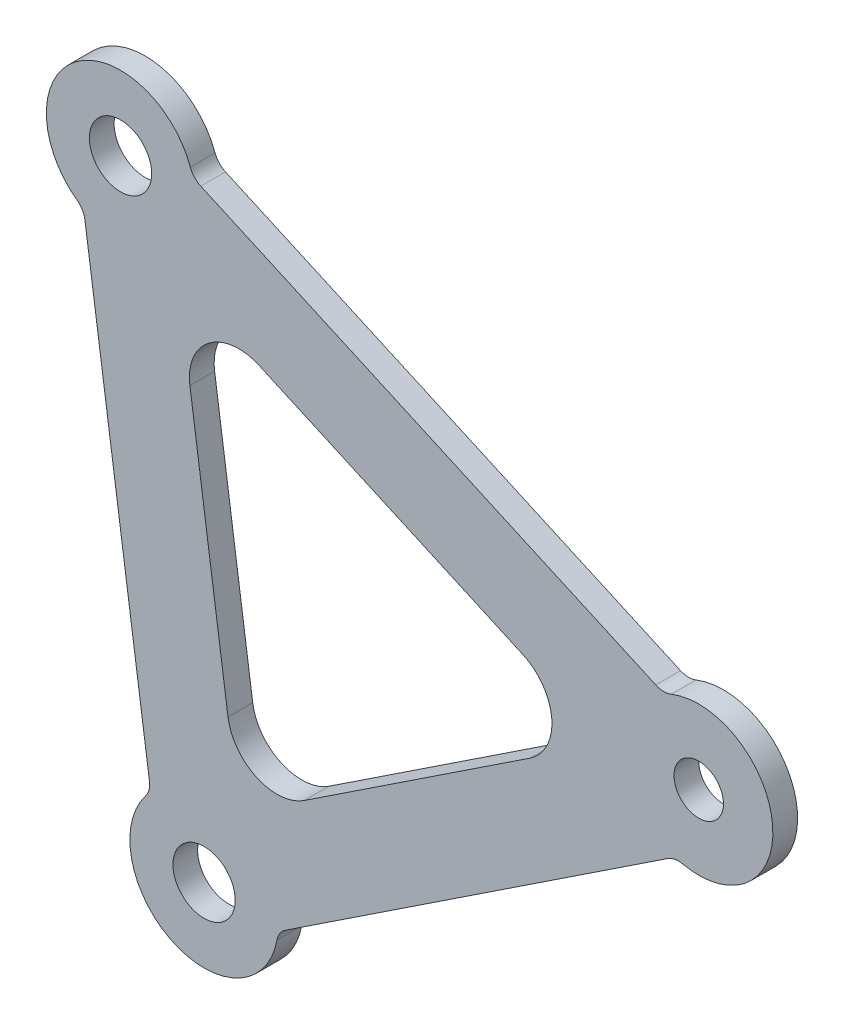
ISO-10303-21;
HEADER;
FILE_DESCRIPTION(('STEP AP214'),'2;1');
FILE_NAME('part.step','',(''),(''),'','','');
FILE_SCHEMA(('AUTOMOTIVE_DESIGN { 1 0 10303 214 1 1 1 1 }'));
ENDSEC;
DATA;
#1=APPLICATION_CONTEXT('core data for automotive mechanical design processes');
#2=APPLICATION_PROTOCOL_DEFINITION('international standard','automotive_design',2000,#1);
#3=PRODUCT_CONTEXT('',#1,'mechanical');
#4=PRODUCT('Part','Part','',(#3));
#5=PRODUCT_RELATED_PRODUCT_CATEGORY('part','',(#4));
#6=PRODUCT_DEFINITION_FORMATION('','',#4);
#7=PRODUCT_DEFINITION_CONTEXT('part definition',#1,'design');
#8=PRODUCT_DEFINITION('design','',#6,#7);
#9=PRODUCT_DEFINITION_SHAPE('','',#8);
#10=(LENGTH_UNIT() NAMED_UNIT(*) SI_UNIT(.MILLI.,.METRE.));
#11=(NAMED_UNIT(*) PLANE_ANGLE_UNIT() SI_UNIT($,.RADIAN.));
#12=(NAMED_UNIT(*) SI_UNIT($,.STERADIAN.) SOLID_ANGLE_UNIT());
#13=UNCERTAINTY_MEASURE_WITH_UNIT(LENGTH_MEASURE(1.E-05),#10,'distance_accuracy_value','');
#14=(GEOMETRIC_REPRESENTATION_CONTEXT(3) GLOBAL_UNCERTAINTY_ASSIGNED_CONTEXT((#13)) GLOBAL_UNIT_ASSIGNED_CONTEXT((#10,
#11,#12)) REPRESENTATION_CONTEXT('',''));
#15=CARTESIAN_POINT('',(0.,0.,0.));
#16=DIRECTION('',(0.,0.,1.));
#17=DIRECTION('',(1.,0.,0.));
#18=AXIS2_PLACEMENT_3D('',#15,#16,#17);
#19=CARTESIAN_POINT('',(0.,0.,1580.80491284533));
#20=DIRECTION('',(0.,0.,1.));
#21=DIRECTION('',(1.,0.,0.));
#22=AXIS2_PLACEMENT_3D('',#19,#20,#21);
#23=PLANE('',#22);
#24=CARTESIAN_POINT('',(226.780244032759,617.201596269697,1580.80491284533));
#25=DIRECTION('',(0.,0.,1.));
#26=DIRECTION('',(1.,0.,0.));
#27=AXIS2_PLACEMENT_3D('',#24,#25,#26);
#28=CIRCLE('',#27,4.00000000000002);
#29=CARTESIAN_POINT('',(230.780244032759,617.201596269697,1580.80491284533));
#30=VERTEX_POINT('',#29);
#31=EDGE_CURVE('E194',#30,#30,#28,.T.);
#32=ORIENTED_EDGE('',*,*,#31,.F.);
#33=EDGE_LOOP('',(#32));
#34=FACE_BOUND('',#33,.T.);
#35=CARTESIAN_POINT('',(216.050914922103,692.64244393749,1580.80491284533));
#36=DIRECTION('',(0.,0.,1.));
#37=DIRECTION('',(1.,0.,0.));
#38=AXIS2_PLACEMENT_3D('',#35,#36,#37);
#39=CIRCLE('',#38,4.00000000000002);
#40=CARTESIAN_POINT('',(220.050914922103,692.64244393749,1580.80491284533));
#41=VERTEX_POINT('',#40);
#42=EDGE_CURVE('E295',#41,#41,#39,.T.);
#43=ORIENTED_EDGE('',*,*,#42,.F.);
#44=EDGE_LOOP('',(#43));
#45=FACE_BOUND('',#44,.T.);
#46=CARTESIAN_POINT('',(290.308718482655,659.279772728152,1580.80491284533));
#47=DIRECTION('',(0.,0.,1.));
#48=DIRECTION('',(1.,0.,0.));
#49=AXIS2_PLACEMENT_3D('',#46,#47,#48);
#50=CIRCLE('',#49,3.17500000000002);
#51=CARTESIAN_POINT('',(293.483718482656,659.279772728152,1580.80491284533));
#52=VERTEX_POINT('',#51);
#53=EDGE_CURVE('E186',#52,#52,#50,.T.);
#54=ORIENTED_EDGE('',*,*,#53,.F.);
#55=EDGE_LOOP('',(#54));
#56=FACE_BOUND('',#55,.T.);
#57=CARTESIAN_POINT('',(290.308718482656,659.279772728152,1580.80491284533));
#58=DIRECTION('',(0.,0.,1.));
#59=DIRECTION('',(1.,0.,0.));
#60=AXIS2_PLACEMENT_3D('',#57,#58,#59);
#61=CIRCLE('',#60,9.52499999999998);
#62=CARTESIAN_POINT('',(288.261525890208,649.977373710188,1580.80491284533));
#63=VERTEX_POINT('',#62);
#64=CARTESIAN_POINT('',(286.78126341768,668.127523050385,1580.80491284533));
#65=VERTEX_POINT('',#64);
#66=EDGE_CURVE('E374',#63,#65,#61,.T.);
#67=ORIENTED_EDGE('',*,*,#66,.T.);
#68=CARTESIAN_POINT('',(285.840608733686,670.486923136314,1580.80491284533));
#69=DIRECTION('',(0.,0.,1.));
#70=DIRECTION('',(1.,0.,0.));
#71=AXIS2_PLACEMENT_3D('',#68,#69,#70);
#72=CIRCLE('',#71,2.54);
#73=CARTESIAN_POINT('',(284.799666641854,668.170020125515,1580.80491284533));
#74=VERTEX_POINT('',#73);
#75=EDGE_CURVE('E244',#65,#74,#72,.F.);
#76=ORIENTED_EDGE('',*,*,#75,.T.);
#77=DIRECTION('',(-0.912166539684771,0.40981972119398,0.));
#78=VECTOR('',#77,1.);
#79=CARTESIAN_POINT('',(297.610612352361,662.414296832786,1580.80491284533));
#80=LINE('',#79,#78);
#81=CARTESIAN_POINT('',(226.356224769418,694.427588246853,1580.80491284533));
#82=VERTEX_POINT('',#81);
#83=EDGE_CURVE('E378',#74,#82,#80,.T.);
#84=ORIENTED_EDGE('',*,*,#83,.T.);
#85=CARTESIAN_POINT('',(227.39716686125,696.744491257652,1580.80491284533));
#86=DIRECTION('',(0.,0.,1.));
#87=DIRECTION('',(1.,0.,0.));
#88=AXIS2_PLACEMENT_3D('',#85,#86,#87);
#89=CIRCLE('',#88,2.54);
#90=CARTESIAN_POINT('',(225.008482244984,695.8809023485,1580.80491284533));
#91=VERTEX_POINT('',#90);
#92=EDGE_CURVE('E12',#82,#91,#89,.F.);
#93=ORIENTED_EDGE('',*,*,#92,.T.);
#94=CARTESIAN_POINT('',(216.050914933983,692.64244393918,1580.80491284533));
#95=DIRECTION('',(0.,0.,1.));
#96=DIRECTION('',(1.,0.,0.));
#97=AXIS2_PLACEMENT_3D('',#94,#95,#96);
#98=CIRCLE('',#97,9.52500000000004);
#99=CARTESIAN_POINT('',(210.455529521926,684.934182975088,1580.80491284533));
#100=VERTEX_POINT('',#99);
#101=EDGE_CURVE('E279',#91,#100,#98,.T.);
#102=ORIENTED_EDGE('',*,*,#101,.T.);
#103=CARTESIAN_POINT('',(208.963426745378,682.878646717997,1580.80491284533));
#104=DIRECTION('',(0.,0.,1.));
#105=DIRECTION('',(1.,0.,0.));
#106=AXIS2_PLACEMENT_3D('',#103,#104,#105);
#107=CIRCLE('',#106,2.54);
#108=CARTESIAN_POINT('',(211.478121667694,683.23629102129,1580.80491284533));
#109=VERTEX_POINT('',#108);
#110=EDGE_CURVE('E260',#100,#109,#107,.F.);
#111=ORIENTED_EDGE('',*,*,#110,.T.);
#112=DIRECTION('',(0.140804843815963,-0.990037370990592,0.));
#113=VECTOR('',#112,1.);
#114=CARTESIAN_POINT('',(302.529900227524,43.0263307218127,1580.80491284533));
#115=LINE('',#114,#113);
#116=CARTESIAN_POINT('',(219.766297064193,624.959862757328,1580.80491284533));
#117=VERTEX_POINT('',#116);
#118=EDGE_CURVE('E281',#109,#117,#115,.T.);
#119=ORIENTED_EDGE('',*,*,#118,.T.);
#120=CARTESIAN_POINT('',(217.251602141877,624.602218454036,1580.80491284533));
#121=DIRECTION('',(0.,0.,1.));
#122=DIRECTION('',(1.,0.,0.));
#123=AXIS2_PLACEMENT_3D('',#120,#121,#122);
#124=CIRCLE('',#123,2.54);
#125=CARTESIAN_POINT('',(219.257632013642,623.044192731017,1580.80491284533));
#126=VERTEX_POINT('',#125);
#127=EDGE_CURVE('E256',#117,#126,#124,.F.);
#128=ORIENTED_EDGE('',*,*,#127,.T.);
#129=CARTESIAN_POINT('',(226.780244032759,617.201596269697,1580.80491284533));
#130=DIRECTION('',(0.,0.,1.));
#131=DIRECTION('',(1.,0.,0.));
#132=AXIS2_PLACEMENT_3D('',#129,#130,#131);
#133=CIRCLE('',#132,9.52499999999998);
#134=CARTESIAN_POINT('',(236.144181170667,615.45737544729,1580.80491284533));
#135=VERTEX_POINT('',#134);
#136=EDGE_CURVE('E286',#126,#135,#133,.T.);
#137=ORIENTED_EDGE('',*,*,#136,.T.);
#138=CARTESIAN_POINT('',(238.641231074109,614.992249894648,1580.80491284533));
#139=DIRECTION('',(0.,0.,1.));
#140=DIRECTION('',(1.,0.,0.));
#141=AXIS2_PLACEMENT_3D('',#138,#139,#140);
#142=CIRCLE('',#141,2.54);
#143=CARTESIAN_POINT('',(237.238625192161,617.109865709645,1580.80491284533));
#144=VERTEX_POINT('',#143);
#145=EDGE_CURVE('E252',#135,#144,#142,.F.);
#146=ORIENTED_EDGE('',*,*,#145,.T.);
#147=DIRECTION('',(0.833707013778167,0.552207040137204,0.));
#148=VECTOR('',#147,1.);
#149=CARTESIAN_POINT('',(-211.762555904941,319.713287374378,1580.80491284533));
#150=LINE('',#149,#148);
#151=CARTESIAN_POINT('',(286.313001983606,649.61434978706,1580.80491284533));
#152=VERTEX_POINT('',#151);
#153=EDGE_CURVE('E372',#144,#152,#150,.T.);
#154=ORIENTED_EDGE('',*,*,#153,.T.);
#155=CARTESIAN_POINT('',(287.715607865555,647.496733972064,1580.80491284533));
#156=DIRECTION('',(0.,0.,1.));
#157=DIRECTION('',(1.,0.,0.));
#158=AXIS2_PLACEMENT_3D('',#155,#156,#157);
#159=CIRCLE('',#158,2.54);
#160=EDGE_CURVE('E248',#152,#63,#159,.F.);
#161=ORIENTED_EDGE('',*,*,#160,.T.);
#162=EDGE_LOOP('',(#67,#76,#84,#93,#102,#111,#119,#128,#137,#146,#154,#161));
#163=FACE_BOUND('',#162,.T.);
#164=DIRECTION('',(-0.833707013778166,-0.552207040137205,0.));
#165=VECTOR('',#164,1.);
#166=CARTESIAN_POINT('',(-218.225220565293,329.470440875522,1580.80491284533));
#167=LINE('',#166,#165);
#168=CARTESIAN_POINT('',(268.616255484679,651.930593018509,1580.80491284533));
#169=VERTEX_POINT('',#168);
#170=CARTESIAN_POINT('',(239.647905772852,632.743364906399,1580.80491284533));
#171=VERTEX_POINT('',#170);
#172=EDGE_CURVE('E182',#169,#171,#167,.T.);
#173=ORIENTED_EDGE('',*,*,#172,.T.);
#174=CARTESIAN_POINT('',(236.14139106798,638.037404443891,1580.80491284533));
#175=DIRECTION('',(0.,0.,1.));
#176=DIRECTION('',(1.,0.,0.));
#177=AXIS2_PLACEMENT_3D('',#174,#175,#176);
#178=CIRCLE('',#177,6.35);
#179=CARTESIAN_POINT('',(229.85465376219,637.14329368566,1580.80491284533));
#180=VERTEX_POINT('',#179);
#181=EDGE_CURVE('E171',#171,#180,#178,.F.);
#182=ORIENTED_EDGE('',*,*,#181,.T.);
#183=DIRECTION('',(-0.140804843815962,0.990037370990592,0.));
#184=VECTOR('',#183,1.);
#185=CARTESIAN_POINT('',(314.116640462379,44.6742171520719,1580.80491284533));
#186=LINE('',#185,#184);
#187=CARTESIAN_POINT('',(224.962186877583,671.543566579862,1580.80491284533));
#188=VERTEX_POINT('',#187);
#189=EDGE_CURVE('E392',#180,#188,#186,.T.);
#190=ORIENTED_EDGE('',*,*,#189,.T.);
#191=CARTESIAN_POINT('',(231.248924183374,672.437677338093,1580.80491284533));
#192=DIRECTION('',(0.,0.,1.));
#193=DIRECTION('',(1.,0.,0.));
#194=AXIS2_PLACEMENT_3D('',#191,#192,#193);
#195=CIRCLE('',#194,6.35);
#196=CARTESIAN_POINT('',(233.851279412955,678.229934865092,1580.80491284533));
#197=VERTEX_POINT('',#196);
#198=EDGE_CURVE('E211',#188,#197,#195,.F.);
#199=ORIENTED_EDGE('',*,*,#198,.T.);
#200=DIRECTION('',(0.912166539684771,-0.409819721193979,0.));
#201=VECTOR('',#200,1.);
#202=CARTESIAN_POINT('',(292.814354360761,651.738905119361,1580.80491284533));
#203=LINE('',#202,#201);
#204=CARTESIAN_POINT('',(267.712096009389,663.016890082999,1580.80491284533));
#205=VERTEX_POINT('',#204);
#206=EDGE_CURVE('E389',#197,#205,#203,.T.);
#207=ORIENTED_EDGE('',*,*,#206,.T.);
#208=CARTESIAN_POINT('',(265.109740779807,657.224632556,1580.80491284533));
#209=DIRECTION('',(0.,0.,1.));
#210=DIRECTION('',(1.,0.,0.));
#211=AXIS2_PLACEMENT_3D('',#208,#209,#210);
#212=CIRCLE('',#211,6.35);
#213=EDGE_CURVE('E172',#205,#169,#212,.F.);
#214=ORIENTED_EDGE('',*,*,#213,.T.);
#215=EDGE_LOOP('',(#173,#182,#190,#199,#207,#214));
#216=FACE_BOUND('',#215,.T.);
#217=ADVANCED_FACE('F36',(#34,#45,#56,#163,#216),#23,.T.);
#218=CARTESIAN_POINT('',(0.,0.,1577.62991284533));
#219=DIRECTION('',(0.,0.,1.));
#220=DIRECTION('',(1.,0.,0.));
#221=AXIS2_PLACEMENT_3D('',#218,#219,#220);
#222=PLANE('',#221);
#223=DIRECTION('',(-0.140804843815963,0.990037370990592,0.));
#224=VECTOR('',#223,1.);
#225=CARTESIAN_POINT('',(211.315771723324,684.377817887474,1577.62991284533));
#226=LINE('',#225,#224);
#227=CARTESIAN_POINT('',(219.766297064193,624.959862757328,1577.62991284533));
#228=VERTEX_POINT('',#227);
#229=CARTESIAN_POINT('',(211.478121667694,683.23629102129,1577.62991284533));
#230=VERTEX_POINT('',#229);
#231=EDGE_CURVE('E362',#228,#230,#226,.T.);
#232=ORIENTED_EDGE('',*,*,#231,.T.);
#233=CARTESIAN_POINT('',(208.963426745378,682.878646717997,1577.62991284533));
#234=DIRECTION('',(0.,0.,1.));
#235=DIRECTION('',(1.,0.,0.));
#236=AXIS2_PLACEMENT_3D('',#233,#234,#235);
#237=CIRCLE('',#236,2.54);
#238=CARTESIAN_POINT('',(210.455529521926,684.934182975088,1577.62991284533));
#239=VERTEX_POINT('',#238);
#240=EDGE_CURVE('E258',#230,#239,#237,.T.);
#241=ORIENTED_EDGE('',*,*,#240,.T.);
#242=CARTESIAN_POINT('',(216.050914933983,692.64244393918,1577.62991284533));
#243=DIRECTION('',(0.,0.,-1.));
#244=DIRECTION('',(1.,0.,0.));
#245=AXIS2_PLACEMENT_3D('',#242,#243,#244);
#246=CIRCLE('',#245,9.52500000000004);
#247=CARTESIAN_POINT('',(225.008482244984,695.8809023485,1577.62991284533));
#248=VERTEX_POINT('',#247);
#249=EDGE_CURVE('E268',#239,#248,#246,.T.);
#250=ORIENTED_EDGE('',*,*,#249,.T.);
#251=CARTESIAN_POINT('',(227.39716686125,696.744491257652,1577.62991284533));
#252=DIRECTION('',(0.,0.,1.));
#253=DIRECTION('',(1.,0.,0.));
#254=AXIS2_PLACEMENT_3D('',#251,#252,#253);
#255=CIRCLE('',#254,2.54);
#256=CARTESIAN_POINT('',(226.356224769418,694.427588246853,1577.62991284533));
#257=VERTEX_POINT('',#256);
#258=EDGE_CURVE('E44',#248,#257,#255,.T.);
#259=ORIENTED_EDGE('',*,*,#258,.T.);
#260=DIRECTION('',(0.912166539684771,-0.40981972119398,0.));
#261=VECTOR('',#260,1.);
#262=CARTESIAN_POINT('',(225.304484054278,694.900116088968,1577.62991284533));
#263=LINE('',#262,#261);
#264=CARTESIAN_POINT('',(284.799666641854,668.170020125515,1577.62991284533));
#265=VERTEX_POINT('',#264);
#266=EDGE_CURVE('E267',#257,#265,#263,.T.);
#267=ORIENTED_EDGE('',*,*,#266,.T.);
#268=CARTESIAN_POINT('',(285.840608733686,670.486923136314,1577.62991284533));
#269=DIRECTION('',(0.,0.,1.));
#270=DIRECTION('',(1.,0.,0.));
#271=AXIS2_PLACEMENT_3D('',#268,#269,#270);
#272=CIRCLE('',#271,2.54);
#273=CARTESIAN_POINT('',(286.78126341768,668.127523050385,1577.62991284533));
#274=VERTEX_POINT('',#273);
#275=EDGE_CURVE('E242',#265,#274,#272,.T.);
#276=ORIENTED_EDGE('',*,*,#275,.T.);
#277=CARTESIAN_POINT('',(290.308718482656,659.279772728152,1577.62991284533));
#278=DIRECTION('',(0.,0.,-1.));
#279=DIRECTION('',(1.,0.,0.));
#280=AXIS2_PLACEMENT_3D('',#277,#278,#279);
#281=CIRCLE('',#280,9.52499999999998);
#282=CARTESIAN_POINT('',(288.261525890208,649.977373710188,1577.62991284533));
#283=VERTEX_POINT('',#282);
#284=EDGE_CURVE('E276',#274,#283,#281,.T.);
#285=ORIENTED_EDGE('',*,*,#284,.T.);
#286=CARTESIAN_POINT('',(287.715607865555,647.496733972064,1577.62991284533));
#287=DIRECTION('',(0.,0.,1.));
#288=DIRECTION('',(1.,0.,0.));
#289=AXIS2_PLACEMENT_3D('',#286,#287,#288);
#290=CIRCLE('',#289,2.54);
#291=CARTESIAN_POINT('',(286.313001983606,649.61434978706,1577.62991284533));
#292=VERTEX_POINT('',#291);
#293=EDGE_CURVE('E246',#283,#292,#290,.T.);
#294=ORIENTED_EDGE('',*,*,#293,.T.);
#295=DIRECTION('',(-0.833707013778167,-0.552207040137204,0.));
#296=VECTOR('',#295,1.);
#297=CARTESIAN_POINT('',(236.277349403347,616.473163307813,1577.62991284533));
#298=LINE('',#297,#296);
#299=CARTESIAN_POINT('',(237.23862519216,617.109865709645,1577.62991284533));
#300=VERTEX_POINT('',#299);
#301=EDGE_CURVE('E383',#292,#300,#298,.T.);
#302=ORIENTED_EDGE('',*,*,#301,.T.);
#303=CARTESIAN_POINT('',(238.641231074109,614.992249894648,1577.62991284533));
#304=DIRECTION('',(0.,0.,1.));
#305=DIRECTION('',(1.,0.,0.));
#306=AXIS2_PLACEMENT_3D('',#303,#304,#305);
#307=CIRCLE('',#306,2.54);
#308=CARTESIAN_POINT('',(236.144181170667,615.45737544729,1577.62991284533));
#309=VERTEX_POINT('',#308);
#310=EDGE_CURVE('E250',#300,#309,#307,.T.);
#311=ORIENTED_EDGE('',*,*,#310,.T.);
#312=CARTESIAN_POINT('',(226.780244032759,617.201596269697,1577.62991284533));
#313=DIRECTION('',(0.,0.,-1.));
#314=DIRECTION('',(1.,0.,0.));
#315=AXIS2_PLACEMENT_3D('',#312,#313,#314);
#316=CIRCLE('',#315,9.52499999999998);
#317=CARTESIAN_POINT('',(219.257632013642,623.044192731017,1577.62991284533));
#318=VERTEX_POINT('',#317);
#319=EDGE_CURVE('E381',#309,#318,#316,.T.);
#320=ORIENTED_EDGE('',*,*,#319,.T.);
#321=CARTESIAN_POINT('',(217.251602141877,624.602218454036,1577.62991284533));
#322=DIRECTION('',(0.,0.,1.));
#323=DIRECTION('',(1.,0.,0.));
#324=AXIS2_PLACEMENT_3D('',#321,#322,#323);
#325=CIRCLE('',#324,2.54);
#326=EDGE_CURVE('E254',#318,#228,#325,.T.);
#327=ORIENTED_EDGE('',*,*,#326,.T.);
#328=EDGE_LOOP('',(#232,#241,#250,#259,#267,#276,#285,#294,#302,#311,#320,#327));
#329=FACE_BOUND('',#328,.T.);
#330=CARTESIAN_POINT('',(290.308718482655,659.279772728152,1577.62991284533));
#331=DIRECTION('',(0.,0.,1.));
#332=DIRECTION('',(1.,0.,0.));
#333=AXIS2_PLACEMENT_3D('',#330,#331,#332);
#334=CIRCLE('',#333,3.17500000000002);
#335=CARTESIAN_POINT('',(293.483718482656,659.279772728152,1577.62991284533));
#336=VERTEX_POINT('',#335);
#337=EDGE_CURVE('E191',#336,#336,#334,.T.);
#338=ORIENTED_EDGE('',*,*,#337,.T.);
#339=EDGE_LOOP('',(#338));
#340=FACE_BOUND('',#339,.T.);
#341=CARTESIAN_POINT('',(216.050914922103,692.64244393749,1577.62991284533));
#342=DIRECTION('',(0.,0.,1.));
#343=DIRECTION('',(1.,0.,0.));
#344=AXIS2_PLACEMENT_3D('',#341,#342,#343);
#345=CIRCLE('',#344,4.00000000000002);
#346=CARTESIAN_POINT('',(220.050914922103,692.64244393749,1577.62991284533));
#347=VERTEX_POINT('',#346);
#348=EDGE_CURVE('E292',#347,#347,#345,.T.);
#349=ORIENTED_EDGE('',*,*,#348,.T.);
#350=EDGE_LOOP('',(#349));
#351=FACE_BOUND('',#350,.T.);
#352=CARTESIAN_POINT('',(226.780244032759,617.201596269697,1577.62991284533));
#353=DIRECTION('',(0.,0.,1.));
#354=DIRECTION('',(1.,0.,0.));
#355=AXIS2_PLACEMENT_3D('',#352,#353,#354);
#356=CIRCLE('',#355,4.00000000000002);
#357=CARTESIAN_POINT('',(230.780244032759,617.201596269697,1577.62991284533));
#358=VERTEX_POINT('',#357);
#359=EDGE_CURVE('E284',#358,#358,#356,.T.);
#360=ORIENTED_EDGE('',*,*,#359,.T.);
#361=EDGE_LOOP('',(#360));
#362=FACE_BOUND('',#361,.T.);
#363=DIRECTION('',(0.833707013778166,0.552207040137205,0.));
#364=VECTOR('',#363,1.);
#365=CARTESIAN_POINT('',(231.269656883051,627.194019699378,1577.62991284533));
#366=LINE('',#365,#364);
#367=CARTESIAN_POINT('',(239.647905772852,632.743364906399,1577.62991284533));
#368=VERTEX_POINT('',#367);
#369=CARTESIAN_POINT('',(268.616255484679,651.930593018509,1577.62991284533));
#370=VERTEX_POINT('',#369);
#371=EDGE_CURVE('E164',#368,#370,#366,.T.);
#372=ORIENTED_EDGE('',*,*,#371,.T.);
#373=CARTESIAN_POINT('',(265.109740779807,657.224632556,1577.62991284533));
#374=DIRECTION('',(0.,0.,1.));
#375=DIRECTION('',(1.,0.,0.));
#376=AXIS2_PLACEMENT_3D('',#373,#374,#375);
#377=CIRCLE('',#376,6.35);
#378=CARTESIAN_POINT('',(267.712096009389,663.016890082999,1577.62991284533));
#379=VERTEX_POINT('',#378);
#380=EDGE_CURVE('E205',#370,#379,#377,.T.);
#381=ORIENTED_EDGE('',*,*,#380,.T.);
#382=DIRECTION('',(-0.912166539684771,0.409819721193979,0.));
#383=VECTOR('',#382,1.);
#384=CARTESIAN_POINT('',(278.223809027892,658.294169931476,1577.62991284533));
#385=LINE('',#384,#383);
#386=CARTESIAN_POINT('',(233.851279412955,678.229934865091,1577.62991284533));
#387=VERTEX_POINT('',#386);
#388=EDGE_CURVE('E397',#379,#387,#385,.T.);
#389=ORIENTED_EDGE('',*,*,#388,.T.);
#390=CARTESIAN_POINT('',(231.248924183374,672.437677338093,1577.62991284533));
#391=DIRECTION('',(0.,0.,1.));
#392=DIRECTION('',(1.,0.,0.));
#393=AXIS2_PLACEMENT_3D('',#390,#391,#392);
#394=CIRCLE('',#393,6.35);
#395=CARTESIAN_POINT('',(224.962186877583,671.543566579862,1577.62991284533));
#396=VERTEX_POINT('',#395);
#397=EDGE_CURVE('E209',#387,#396,#394,.T.);
#398=ORIENTED_EDGE('',*,*,#397,.T.);
#399=DIRECTION('',(0.140804843815962,-0.990037370990592,0.));
#400=VECTOR('',#399,1.);
#401=CARTESIAN_POINT('',(223.339566396411,682.952655015734,1577.62991284533));
#402=LINE('',#401,#400);
#403=CARTESIAN_POINT('',(229.85465376219,637.143293685659,1577.62991284533));
#404=VERTEX_POINT('',#403);
#405=EDGE_CURVE('E166',#396,#404,#402,.T.);
#406=ORIENTED_EDGE('',*,*,#405,.T.);
#407=CARTESIAN_POINT('',(236.14139106798,638.037404443891,1577.62991284533));
#408=DIRECTION('',(0.,0.,1.));
#409=DIRECTION('',(1.,0.,0.));
#410=AXIS2_PLACEMENT_3D('',#407,#408,#409);
#411=CIRCLE('',#410,6.35);
#412=EDGE_CURVE('E161',#404,#368,#411,.T.);
#413=ORIENTED_EDGE('',*,*,#412,.T.);
#414=EDGE_LOOP('',(#372,#381,#389,#398,#406,#413));
#415=FACE_BOUND('',#414,.T.);
#416=ADVANCED_FACE('F163',(#329,#340,#351,#362,#415),#222,.F.);
#417=CARTESIAN_POINT('',(226.780244032759,617.201596269697,1580.80491284533));
#418=DIRECTION('',(0.,0.,-1.));
#419=DIRECTION('',(-1.,0.,0.));
#420=AXIS2_PLACEMENT_3D('',#417,#418,#419);
#421=CYLINDRICAL_SURFACE('',#420,4.00000000000002);
#422=ORIENTED_EDGE('',*,*,#31,.T.);
#423=EDGE_LOOP('',(#422));
#424=FACE_BOUND('',#423,.T.);
#425=ORIENTED_EDGE('',*,*,#359,.F.);
#426=EDGE_LOOP('',(#425));
#427=FACE_BOUND('',#426,.T.);
#428=ADVANCED_FACE('F301',(#424,#427),#421,.F.);
#429=CARTESIAN_POINT('',(216.050914922103,692.64244393749,1580.80491284533));
#430=DIRECTION('',(0.,0.,-1.));
#431=DIRECTION('',(-1.,0.,0.));
#432=AXIS2_PLACEMENT_3D('',#429,#430,#431);
#433=CYLINDRICAL_SURFACE('',#432,4.00000000000002);
#434=ORIENTED_EDGE('',*,*,#42,.T.);
#435=EDGE_LOOP('',(#434));
#436=FACE_BOUND('',#435,.T.);
#437=ORIENTED_EDGE('',*,*,#348,.F.);
#438=EDGE_LOOP('',(#437));
#439=FACE_BOUND('',#438,.T.);
#440=ADVANCED_FACE('F303',(#436,#439),#433,.F.);
#441=CARTESIAN_POINT('',(290.308718482655,659.279772728152,1580.80491284533));
#442=DIRECTION('',(0.,0.,-1.));
#443=DIRECTION('',(-1.,0.,0.));
#444=AXIS2_PLACEMENT_3D('',#441,#442,#443);
#445=CYLINDRICAL_SURFACE('',#444,3.17500000000002);
#446=ORIENTED_EDGE('',*,*,#53,.T.);
#447=EDGE_LOOP('',(#446));
#448=FACE_BOUND('',#447,.T.);
#449=ORIENTED_EDGE('',*,*,#337,.F.);
#450=EDGE_LOOP('',(#449));
#451=FACE_BOUND('',#450,.T.);
#452=ADVANCED_FACE('F310',(#448,#451),#445,.F.);
#453=CARTESIAN_POINT('',(216.050914933983,692.64244393918,1581.43991284533));
#454=DIRECTION('',(0.,0.,-1.));
#455=DIRECTION('',(-1.,0.,0.));
#456=AXIS2_PLACEMENT_3D('',#453,#454,#455);
#457=CYLINDRICAL_SURFACE('',#456,9.52500000000004);
#458=ORIENTED_EDGE('',*,*,#249,.F.);
#459=DIRECTION('',(0.,0.,-1.));
#460=VECTOR('',#459,1.);
#461=CARTESIAN_POINT('',(210.455529521926,684.934182975088,1581.43991284533));
#462=LINE('',#461,#460);
#463=EDGE_CURVE('E51',#239,#100,#462,.F.);
#464=ORIENTED_EDGE('',*,*,#463,.T.);
#465=ORIENTED_EDGE('',*,*,#101,.F.);
#466=DIRECTION('',(0.,0.,-1.));
#467=VECTOR('',#466,1.);
#468=CARTESIAN_POINT('',(225.008482244984,695.8809023485,1581.43991284533));
#469=LINE('',#468,#467);
#470=EDGE_CURVE('E238',#91,#248,#469,.T.);
#471=ORIENTED_EDGE('',*,*,#470,.T.);
#472=EDGE_LOOP('',(#458,#464,#465,#471));
#473=FACE_BOUND('',#472,.T.);
#474=ADVANCED_FACE('F278',(#473),#457,.T.);
#475=CARTESIAN_POINT('',(211.315771723324,684.377817887474,1581.43991284533));
#476=DIRECTION('',(-0.990037370990592,-0.140804843815963,0.));
#477=DIRECTION('',(0.140804843815963,-0.990037370990592,0.));
#478=AXIS2_PLACEMENT_3D('',#475,#476,#477);
#479=PLANE('',#478);
#480=ORIENTED_EDGE('',*,*,#231,.F.);
#481=DIRECTION('',(0.,0.,1.));
#482=VECTOR('',#481,1.);
#483=CARTESIAN_POINT('',(219.766297064193,624.959862757328,1580.80491284533));
#484=LINE('',#483,#482);
#485=EDGE_CURVE('E236',#228,#117,#484,.T.);
#486=ORIENTED_EDGE('',*,*,#485,.T.);
#487=ORIENTED_EDGE('',*,*,#118,.F.);
#488=DIRECTION('',(0.,0.,1.));
#489=VECTOR('',#488,1.);
#490=CARTESIAN_POINT('',(211.478121667694,683.23629102129,1577.62991284533));
#491=LINE('',#490,#489);
#492=EDGE_CURVE('E233',#109,#230,#491,.F.);
#493=ORIENTED_EDGE('',*,*,#492,.T.);
#494=EDGE_LOOP('',(#480,#486,#487,#493));
#495=FACE_BOUND('',#494,.T.);
#496=ADVANCED_FACE('F360',(#495),#479,.T.);
#497=CARTESIAN_POINT('',(226.780244032759,617.201596269697,1581.43991284533));
#498=DIRECTION('',(0.,0.,-1.));
#499=DIRECTION('',(-1.,0.,0.));
#500=AXIS2_PLACEMENT_3D('',#497,#498,#499);
#501=CYLINDRICAL_SURFACE('',#500,9.52499999999998);
#502=ORIENTED_EDGE('',*,*,#319,.F.);
#503=DIRECTION('',(0.,0.,-1.));
#504=VECTOR('',#503,1.);
#505=CARTESIAN_POINT('',(236.144181170667,615.45737544729,1581.43991284533));
#506=LINE('',#505,#504);
#507=EDGE_CURVE('E231',#309,#135,#506,.F.);
#508=ORIENTED_EDGE('',*,*,#507,.T.);
#509=ORIENTED_EDGE('',*,*,#136,.F.);
#510=DIRECTION('',(0.,0.,-1.));
#511=VECTOR('',#510,1.);
#512=CARTESIAN_POINT('',(219.257632013642,623.044192731017,1581.43991284533));
#513=LINE('',#512,#511);
#514=EDGE_CURVE('E228',#126,#318,#513,.T.);
#515=ORIENTED_EDGE('',*,*,#514,.T.);
#516=EDGE_LOOP('',(#502,#508,#509,#515));
#517=FACE_BOUND('',#516,.T.);
#518=ADVANCED_FACE('F369',(#517),#501,.T.);
#519=CARTESIAN_POINT('',(236.277349403347,616.473163307813,1581.43991284533));
#520=DIRECTION('',(0.552207040137204,-0.833707013778167,0.));
#521=DIRECTION('',(0.833707013778167,0.552207040137204,0.));
#522=AXIS2_PLACEMENT_3D('',#519,#520,#521);
#523=PLANE('',#522);
#524=ORIENTED_EDGE('',*,*,#301,.F.);
#525=DIRECTION('',(0.,0.,1.));
#526=VECTOR('',#525,1.);
#527=CARTESIAN_POINT('',(286.313001983606,649.61434978706,1580.80491284533));
#528=LINE('',#527,#526);
#529=EDGE_CURVE('E226',#292,#152,#528,.T.);
#530=ORIENTED_EDGE('',*,*,#529,.T.);
#531=ORIENTED_EDGE('',*,*,#153,.F.);
#532=DIRECTION('',(0.,0.,1.));
#533=VECTOR('',#532,1.);
#534=CARTESIAN_POINT('',(237.23862519216,617.109865709645,1577.62991284533));
#535=LINE('',#534,#533);
#536=EDGE_CURVE('E223',#144,#300,#535,.F.);
#537=ORIENTED_EDGE('',*,*,#536,.T.);
#538=EDGE_LOOP('',(#524,#530,#531,#537));
#539=FACE_BOUND('',#538,.T.);
#540=ADVANCED_FACE('F424',(#539),#523,.T.);
#541=CARTESIAN_POINT('',(290.308718482656,659.279772728152,1581.43991284533));
#542=DIRECTION('',(0.,0.,-1.));
#543=DIRECTION('',(-1.,0.,0.));
#544=AXIS2_PLACEMENT_3D('',#541,#542,#543);
#545=CYLINDRICAL_SURFACE('',#544,9.52499999999998);
#546=ORIENTED_EDGE('',*,*,#284,.F.);
#547=DIRECTION('',(0.,0.,-1.));
#548=VECTOR('',#547,1.);
#549=CARTESIAN_POINT('',(286.78126341768,668.127523050385,1581.43991284533));
#550=LINE('',#549,#548);
#551=EDGE_CURVE('E221',#274,#65,#550,.F.);
#552=ORIENTED_EDGE('',*,*,#551,.T.);
#553=ORIENTED_EDGE('',*,*,#66,.F.);
#554=DIRECTION('',(0.,0.,-1.));
#555=VECTOR('',#554,1.);
#556=CARTESIAN_POINT('',(288.261525890208,649.977373710188,1581.43991284533));
#557=LINE('',#556,#555);
#558=EDGE_CURVE('E218',#63,#283,#557,.T.);
#559=ORIENTED_EDGE('',*,*,#558,.T.);
#560=EDGE_LOOP('',(#546,#552,#553,#559));
#561=FACE_BOUND('',#560,.T.);
#562=ADVANCED_FACE('F427',(#561),#545,.T.);
#563=CARTESIAN_POINT('',(225.304484054278,694.900116088968,1581.43991284533));
#564=DIRECTION('',(0.40981972119398,0.912166539684771,0.));
#565=DIRECTION('',(-0.912166539684771,0.40981972119398,0.));
#566=AXIS2_PLACEMENT_3D('',#563,#564,#565);
#567=PLANE('',#566);
#568=ORIENTED_EDGE('',*,*,#83,.F.);
#569=DIRECTION('',(0.,0.,1.));
#570=VECTOR('',#569,1.);
#571=CARTESIAN_POINT('',(284.799666641854,668.170020125515,1577.62991284533));
#572=LINE('',#571,#570);
#573=EDGE_CURVE('E215',#74,#265,#572,.F.);
#574=ORIENTED_EDGE('',*,*,#573,.T.);
#575=ORIENTED_EDGE('',*,*,#266,.F.);
#576=DIRECTION('',(0.,0.,1.));
#577=VECTOR('',#576,1.);
#578=CARTESIAN_POINT('',(226.356224769418,694.427588246853,1580.80491284533));
#579=LINE('',#578,#577);
#580=EDGE_CURVE('E213',#257,#82,#579,.T.);
#581=ORIENTED_EDGE('',*,*,#580,.T.);
#582=EDGE_LOOP('',(#568,#574,#575,#581));
#583=FACE_BOUND('',#582,.T.);
#584=ADVANCED_FACE('F274',(#583),#567,.T.);
#585=CARTESIAN_POINT('',(278.223809027892,658.294169931476,1581.43991284533));
#586=DIRECTION('',(-0.409819721193979,-0.912166539684771,0.));
#587=DIRECTION('',(0.912166539684771,-0.409819721193979,0.));
#588=AXIS2_PLACEMENT_3D('',#585,#586,#587);
#589=PLANE('',#588);
#590=ORIENTED_EDGE('',*,*,#388,.F.);
#591=DIRECTION('',(0.,0.,-1.));
#592=VECTOR('',#591,1.);
#593=CARTESIAN_POINT('',(267.712096009389,663.016890082999,1580.80491284533));
#594=LINE('',#593,#592);
#595=EDGE_CURVE('E199',#379,#205,#594,.F.);
#596=ORIENTED_EDGE('',*,*,#595,.T.);
#597=ORIENTED_EDGE('',*,*,#206,.F.);
#598=DIRECTION('',(0.,0.,-1.));
#599=VECTOR('',#598,1.);
#600=CARTESIAN_POINT('',(233.851279412955,678.229934865091,1577.62991284533));
#601=LINE('',#600,#599);
#602=EDGE_CURVE('E188',#197,#387,#601,.T.);
#603=ORIENTED_EDGE('',*,*,#602,.T.);
#604=EDGE_LOOP('',(#590,#596,#597,#603));
#605=FACE_BOUND('',#604,.T.);
#606=ADVANCED_FACE('F402',(#605),#589,.T.);
#607=CARTESIAN_POINT('',(223.339566396411,682.952655015734,1581.43991284533));
#608=DIRECTION('',(0.990037370990592,0.140804843815962,0.));
#609=DIRECTION('',(-0.140804843815962,0.990037370990592,0.));
#610=AXIS2_PLACEMENT_3D('',#607,#608,#609);
#611=PLANE('',#610);
#612=ORIENTED_EDGE('',*,*,#189,.F.);
#613=DIRECTION('',(0.,0.,-1.));
#614=VECTOR('',#613,1.);
#615=CARTESIAN_POINT('',(229.85465376219,637.143293685659,1577.62991284533));
#616=LINE('',#615,#614);
#617=EDGE_CURVE('E203',#180,#404,#616,.T.);
#618=ORIENTED_EDGE('',*,*,#617,.T.);
#619=ORIENTED_EDGE('',*,*,#405,.F.);
#620=DIRECTION('',(0.,0.,-1.));
#621=VECTOR('',#620,1.);
#622=CARTESIAN_POINT('',(224.962186877583,671.543566579862,1580.80491284533));
#623=LINE('',#622,#621);
#624=EDGE_CURVE('E201',#396,#188,#623,.F.);
#625=ORIENTED_EDGE('',*,*,#624,.T.);
#626=EDGE_LOOP('',(#612,#618,#619,#625));
#627=FACE_BOUND('',#626,.T.);
#628=ADVANCED_FACE('F410',(#627),#611,.T.);
#629=CARTESIAN_POINT('',(231.269656883051,627.194019699378,1581.43991284533));
#630=DIRECTION('',(-0.552207040137205,0.833707013778166,0.));
#631=DIRECTION('',(-0.833707013778166,-0.552207040137205,0.));
#632=AXIS2_PLACEMENT_3D('',#629,#630,#631);
#633=PLANE('',#632);
#634=ORIENTED_EDGE('',*,*,#172,.F.);
#635=DIRECTION('',(0.,0.,-1.));
#636=VECTOR('',#635,1.);
#637=CARTESIAN_POINT('',(268.616255484679,651.930593018509,1577.62991284533));
#638=LINE('',#637,#636);
#639=EDGE_CURVE('E181',#169,#370,#638,.T.);
#640=ORIENTED_EDGE('',*,*,#639,.T.);
#641=ORIENTED_EDGE('',*,*,#371,.F.);
#642=DIRECTION('',(0.,0.,-1.));
#643=VECTOR('',#642,1.);
#644=CARTESIAN_POINT('',(239.647905772852,632.743364906399,1580.80491284533));
#645=LINE('',#644,#643);
#646=EDGE_CURVE('E178',#368,#171,#645,.F.);
#647=ORIENTED_EDGE('',*,*,#646,.T.);
#648=EDGE_LOOP('',(#634,#640,#641,#647));
#649=FACE_BOUND('',#648,.T.);
#650=ADVANCED_FACE('F177',(#649),#633,.T.);
#651=CARTESIAN_POINT('',(265.109740779807,657.224632556,1581.43991284533));
#652=DIRECTION('',(0.,0.,1.));
#653=DIRECTION('',(1.,0.,0.));
#654=AXIS2_PLACEMENT_3D('',#651,#652,#653);
#655=CYLINDRICAL_SURFACE('',#654,6.35);
#656=ORIENTED_EDGE('',*,*,#213,.F.);
#657=ORIENTED_EDGE('',*,*,#595,.F.);
#658=ORIENTED_EDGE('',*,*,#380,.F.);
#659=ORIENTED_EDGE('',*,*,#639,.F.);
#660=EDGE_LOOP('',(#656,#657,#658,#659));
#661=FACE_BOUND('',#660,.T.);
#662=ADVANCED_FACE('F322',(#661),#655,.F.);
#663=CARTESIAN_POINT('',(236.14139106798,638.037404443891,1581.43991284533));
#664=DIRECTION('',(0.,0.,1.));
#665=DIRECTION('',(1.,0.,0.));
#666=AXIS2_PLACEMENT_3D('',#663,#664,#665);
#667=CYLINDRICAL_SURFACE('',#666,6.35);
#668=ORIENTED_EDGE('',*,*,#181,.F.);
#669=ORIENTED_EDGE('',*,*,#646,.F.);
#670=ORIENTED_EDGE('',*,*,#412,.F.);
#671=ORIENTED_EDGE('',*,*,#617,.F.);
#672=EDGE_LOOP('',(#668,#669,#670,#671));
#673=FACE_BOUND('',#672,.T.);
#674=ADVANCED_FACE('F185',(#673),#667,.F.);
#675=CARTESIAN_POINT('',(231.248924183374,672.437677338093,1581.43991284533));
#676=DIRECTION('',(0.,0.,1.));
#677=DIRECTION('',(1.,0.,0.));
#678=AXIS2_PLACEMENT_3D('',#675,#676,#677);
#679=CYLINDRICAL_SURFACE('',#678,6.35);
#680=ORIENTED_EDGE('',*,*,#198,.F.);
#681=ORIENTED_EDGE('',*,*,#624,.F.);
#682=ORIENTED_EDGE('',*,*,#397,.F.);
#683=ORIENTED_EDGE('',*,*,#602,.F.);
#684=EDGE_LOOP('',(#680,#681,#682,#683));
#685=FACE_BOUND('',#684,.T.);
#686=ADVANCED_FACE('F328',(#685),#679,.F.);
#687=CARTESIAN_POINT('',(285.840608733686,670.486923136314,1581.43991284533));
#688=DIRECTION('',(0.,0.,-1.));
#689=DIRECTION('',(-1.,0.,0.));
#690=AXIS2_PLACEMENT_3D('',#687,#688,#689);
#691=CYLINDRICAL_SURFACE('',#690,2.54);
#692=ORIENTED_EDGE('',*,*,#75,.F.);
#693=ORIENTED_EDGE('',*,*,#551,.F.);
#694=ORIENTED_EDGE('',*,*,#275,.F.);
#695=ORIENTED_EDGE('',*,*,#573,.F.);
#696=EDGE_LOOP('',(#692,#693,#694,#695));
#697=FACE_BOUND('',#696,.T.);
#698=ADVANCED_FACE('F331',(#697),#691,.F.);
#699=CARTESIAN_POINT('',(287.715607865555,647.496733972064,1581.43991284533));
#700=DIRECTION('',(0.,0.,-1.));
#701=DIRECTION('',(-1.,0.,0.));
#702=AXIS2_PLACEMENT_3D('',#699,#700,#701);
#703=CYLINDRICAL_SURFACE('',#702,2.54);
#704=ORIENTED_EDGE('',*,*,#160,.F.);
#705=ORIENTED_EDGE('',*,*,#529,.F.);
#706=ORIENTED_EDGE('',*,*,#293,.F.);
#707=ORIENTED_EDGE('',*,*,#558,.F.);
#708=EDGE_LOOP('',(#704,#705,#706,#707));
#709=FACE_BOUND('',#708,.T.);
#710=ADVANCED_FACE('F335',(#709),#703,.F.);
#711=CARTESIAN_POINT('',(238.641231074109,614.992249894648,1581.43991284533));
#712=DIRECTION('',(0.,0.,-1.));
#713=DIRECTION('',(-1.,0.,0.));
#714=AXIS2_PLACEMENT_3D('',#711,#712,#713);
#715=CYLINDRICAL_SURFACE('',#714,2.54);
#716=ORIENTED_EDGE('',*,*,#145,.F.);
#717=ORIENTED_EDGE('',*,*,#507,.F.);
#718=ORIENTED_EDGE('',*,*,#310,.F.);
#719=ORIENTED_EDGE('',*,*,#536,.F.);
#720=EDGE_LOOP('',(#716,#717,#718,#719));
#721=FACE_BOUND('',#720,.T.);
#722=ADVANCED_FACE('F339',(#721),#715,.F.);
#723=CARTESIAN_POINT('',(217.251602141877,624.602218454036,1581.43991284533));
#724=DIRECTION('',(0.,0.,-1.));
#725=DIRECTION('',(-1.,0.,0.));
#726=AXIS2_PLACEMENT_3D('',#723,#724,#725);
#727=CYLINDRICAL_SURFACE('',#726,2.54);
#728=ORIENTED_EDGE('',*,*,#127,.F.);
#729=ORIENTED_EDGE('',*,*,#485,.F.);
#730=ORIENTED_EDGE('',*,*,#326,.F.);
#731=ORIENTED_EDGE('',*,*,#514,.F.);
#732=EDGE_LOOP('',(#728,#729,#730,#731));
#733=FACE_BOUND('',#732,.T.);
#734=ADVANCED_FACE('F343',(#733),#727,.F.);
#735=CARTESIAN_POINT('',(208.963426745378,682.878646717997,1581.43991284533));
#736=DIRECTION('',(0.,0.,-1.));
#737=DIRECTION('',(-1.,0.,0.));
#738=AXIS2_PLACEMENT_3D('',#735,#736,#737);
#739=CYLINDRICAL_SURFACE('',#738,2.54);
#740=ORIENTED_EDGE('',*,*,#110,.F.);
#741=ORIENTED_EDGE('',*,*,#463,.F.);
#742=ORIENTED_EDGE('',*,*,#240,.F.);
#743=ORIENTED_EDGE('',*,*,#492,.F.);
#744=EDGE_LOOP('',(#740,#741,#742,#743));
#745=FACE_BOUND('',#744,.T.);
#746=ADVANCED_FACE('F346',(#745),#739,.F.);
#747=CARTESIAN_POINT('',(227.39716686125,696.744491257652,1581.43991284533));
#748=DIRECTION('',(0.,0.,-1.));
#749=DIRECTION('',(-1.,0.,0.));
#750=AXIS2_PLACEMENT_3D('',#747,#748,#749);
#751=CYLINDRICAL_SURFACE('',#750,2.54);
#752=ORIENTED_EDGE('',*,*,#92,.F.);
#753=ORIENTED_EDGE('',*,*,#580,.F.);
#754=ORIENTED_EDGE('',*,*,#258,.F.);
#755=ORIENTED_EDGE('',*,*,#470,.F.);
#756=EDGE_LOOP('',(#752,#753,#754,#755));
#757=FACE_BOUND('',#756,.T.);
#758=ADVANCED_FACE('F38',(#757),#751,.F.);
#759=CLOSED_SHELL('',(#217,#416,#428,#440,#452,#474,#496,#518,#540,#562,#584,#606,#628,#650,
#662,#674,#686,#698,#710,#722,#734,#746,#758));
#760=MANIFOLD_SOLID_BREP('B2',#759);
#761=ADVANCED_BREP_SHAPE_REPRESENTATION('',(#18,#760),#14);
#762=SHAPE_DEFINITION_REPRESENTATION(#9,#761);
ENDSEC;
END-ISO-10303-21;
